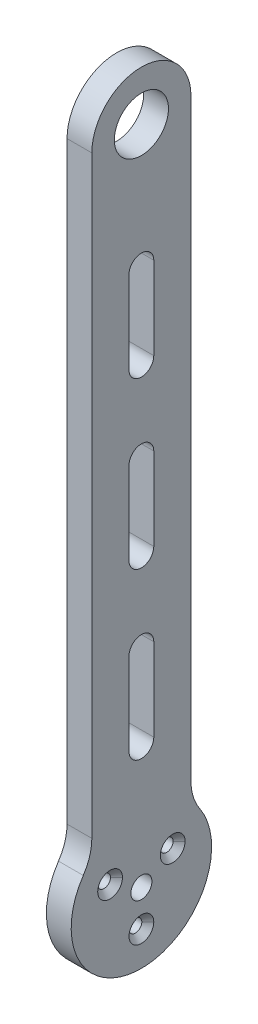
ISO-10303-21;
HEADER;
FILE_DESCRIPTION(('STEP AP214'),'2;1');
FILE_NAME('part.step','',(''),(''),'','','');
FILE_SCHEMA(('AUTOMOTIVE_DESIGN { 1 0 10303 214 1 1 1 1 }'));
ENDSEC;
DATA;
#1=APPLICATION_CONTEXT('core data for automotive mechanical design processes');
#2=APPLICATION_PROTOCOL_DEFINITION('international standard','automotive_design',2000,#1);
#3=PRODUCT_CONTEXT('',#1,'mechanical');
#4=PRODUCT('Part','Part','',(#3));
#5=PRODUCT_RELATED_PRODUCT_CATEGORY('part','',(#4));
#6=PRODUCT_DEFINITION_FORMATION('','',#4);
#7=PRODUCT_DEFINITION_CONTEXT('part definition',#1,'design');
#8=PRODUCT_DEFINITION('design','',#6,#7);
#9=PRODUCT_DEFINITION_SHAPE('','',#8);
#10=(LENGTH_UNIT() NAMED_UNIT(*) SI_UNIT(.MILLI.,.METRE.));
#11=(NAMED_UNIT(*) PLANE_ANGLE_UNIT() SI_UNIT($,.RADIAN.));
#12=(NAMED_UNIT(*) SI_UNIT($,.STERADIAN.) SOLID_ANGLE_UNIT());
#13=UNCERTAINTY_MEASURE_WITH_UNIT(LENGTH_MEASURE(1.E-05),#10,'distance_accuracy_value','');
#14=(GEOMETRIC_REPRESENTATION_CONTEXT(3) GLOBAL_UNCERTAINTY_ASSIGNED_CONTEXT((#13)) GLOBAL_UNIT_ASSIGNED_CONTEXT((#10,
#11,#12)) REPRESENTATION_CONTEXT('',''));
#15=CARTESIAN_POINT('',(0.,0.,0.));
#16=DIRECTION('',(0.,0.,1.));
#17=DIRECTION('',(1.,0.,0.));
#18=AXIS2_PLACEMENT_3D('',#15,#16,#17);
#19=CARTESIAN_POINT('',(1.4159414336793,4.375,7.57772228311384));
#20=DIRECTION('',(1.,0.,0.));
#21=DIRECTION('',(0.,0.,-1.));
#22=AXIS2_PLACEMENT_3D('',#19,#20,#21);
#23=CONICAL_SURFACE('',#22,1.4159414336793,0.785398163397449);
#24=DIRECTION('',(-0.707106781186547,-4.31774598039509E-08,-0.707106781186546));
#25=VECTOR('',#24,1.);
#26=CARTESIAN_POINT('',(2.99999998662978,4.37500018318645,10.5777222697436));
#27=LINE('',#26,#25);
#28=CARTESIAN_POINT('',(2.99999999539441,4.37500005514268,10.5777222785082));
#29=VERTEX_POINT('',#28);
#30=CARTESIAN_POINT('',(1.55,4.37500009464633,9.12772228311382));
#31=VERTEX_POINT('',#30);
#32=EDGE_CURVE('E55',#29,#31,#27,.T.);
#33=ORIENTED_EDGE('',*,*,#32,.T.);
#34=CARTESIAN_POINT('',(1.55,4.375,7.57772228311384));
#35=DIRECTION('',(1.,0.,0.));
#36=DIRECTION('',(0.,0.,-1.));
#37=AXIS2_PLACEMENT_3D('',#34,#35,#36);
#38=CIRCLE('',#37,1.55);
#39=CARTESIAN_POINT('',(1.55,4.37499990535367,6.02772228311384));
#40=VERTEX_POINT('',#39);
#41=EDGE_CURVE('E387',#31,#40,#38,.F.);
#42=ORIENTED_EDGE('',*,*,#41,.T.);
#43=DIRECTION('',(-0.707106781186547,4.31774602128291E-08,0.707106781186546));
#44=VECTOR('',#43,1.);
#45=CARTESIAN_POINT('',(2.99999998662978,4.37499981681355,4.57772229648406));
#46=LINE('',#45,#44);
#47=CARTESIAN_POINT('',(2.99999999539441,4.37499994485732,4.57772228771943));
#48=VERTEX_POINT('',#47);
#49=EDGE_CURVE('E12',#48,#40,#46,.T.);
#50=ORIENTED_EDGE('',*,*,#49,.F.);
#51=CARTESIAN_POINT('',(3.,4.375,7.57772228311384));
#52=DIRECTION('',(-1.,0.,0.));
#53=DIRECTION('',(0.,0.,1.));
#54=AXIS2_PLACEMENT_3D('',#51,#52,#53);
#55=CIRCLE('',#54,3.);
#56=EDGE_CURVE('E464',#29,#48,#55,.T.);
#57=ORIENTED_EDGE('',*,*,#56,.F.);
#58=EDGE_LOOP('',(#33,#42,#50,#57));
#59=FACE_BOUND('',#58,.T.);
#60=ADVANCED_FACE('F52',(#59),#23,.F.);
#61=CARTESIAN_POINT('',(1.4159414336793,4.375,7.57772228311384));
#62=DIRECTION('',(1.,0.,0.));
#63=DIRECTION('',(0.,0.,-1.));
#64=AXIS2_PLACEMENT_3D('',#61,#62,#63);
#65=CONICAL_SURFACE('',#64,1.4159414336793,0.785398163397449);
#66=ORIENTED_EDGE('',*,*,#49,.T.);
#67=CARTESIAN_POINT('',(1.55,4.375,7.57772228311384));
#68=DIRECTION('',(1.,0.,0.));
#69=DIRECTION('',(0.,0.,-1.));
#70=AXIS2_PLACEMENT_3D('',#67,#68,#69);
#71=CIRCLE('',#70,1.55);
#72=EDGE_CURVE('E383',#40,#31,#71,.F.);
#73=ORIENTED_EDGE('',*,*,#72,.T.);
#74=ORIENTED_EDGE('',*,*,#32,.F.);
#75=CARTESIAN_POINT('',(3.,4.375,7.57772228311384));
#76=DIRECTION('',(-1.,0.,0.));
#77=DIRECTION('',(0.,0.,-1.));
#78=AXIS2_PLACEMENT_3D('',#75,#76,#77);
#79=CIRCLE('',#78,3.);
#80=EDGE_CURVE('E460',#48,#29,#79,.T.);
#81=ORIENTED_EDGE('',*,*,#80,.F.);
#82=EDGE_LOOP('',(#66,#73,#74,#81));
#83=FACE_BOUND('',#82,.T.);
#84=ADVANCED_FACE('F542',(#83),#65,.F.);
#85=CARTESIAN_POINT('',(1.4159414336793,4.375,-7.57772228311384));
#86=DIRECTION('',(1.,0.,0.));
#87=DIRECTION('',(0.,0.,-1.));
#88=AXIS2_PLACEMENT_3D('',#85,#86,#87);
#89=CONICAL_SURFACE('',#88,1.4159414336793,0.785398163397449);
#90=DIRECTION('',(-0.707106781186547,-4.31774606217073E-08,-0.707106781186546));
#91=VECTOR('',#90,1.);
#92=CARTESIAN_POINT('',(2.99999998662979,4.37500018318645,-4.57772229648406));
#93=LINE('',#92,#91);
#94=CARTESIAN_POINT('',(2.99999999539441,4.37500005514268,-4.57772228771943));
#95=VERTEX_POINT('',#94);
#96=CARTESIAN_POINT('',(1.55,4.37500009464633,-6.02772228311385));
#97=VERTEX_POINT('',#96);
#98=EDGE_CURVE('E485',#95,#97,#93,.T.);
#99=ORIENTED_EDGE('',*,*,#98,.T.);
#100=CARTESIAN_POINT('',(1.55,4.375,-7.57772228311384));
#101=DIRECTION('',(1.,0.,0.));
#102=DIRECTION('',(0.,0.,-1.));
#103=AXIS2_PLACEMENT_3D('',#100,#101,#102);
#104=CIRCLE('',#103,1.55);
#105=CARTESIAN_POINT('',(1.55,4.37499990535367,-9.12772228311382));
#106=VERTEX_POINT('',#105);
#107=EDGE_CURVE('E363',#97,#106,#104,.F.);
#108=ORIENTED_EDGE('',*,*,#107,.T.);
#109=DIRECTION('',(-0.707106781186548,4.31774598039509E-08,0.707106781186546));
#110=VECTOR('',#109,1.);
#111=CARTESIAN_POINT('',(2.99999998662978,4.37499981681355,-10.5777222697436));
#112=LINE('',#111,#110);
#113=CARTESIAN_POINT('',(2.99999999539441,4.37499994485732,-10.5777222785082));
#114=VERTEX_POINT('',#113);
#115=EDGE_CURVE('E489',#114,#106,#112,.T.);
#116=ORIENTED_EDGE('',*,*,#115,.F.);
#117=CARTESIAN_POINT('',(3.,4.375,-7.57772228311384));
#118=DIRECTION('',(-1.,0.,0.));
#119=DIRECTION('',(0.,0.,1.));
#120=AXIS2_PLACEMENT_3D('',#117,#118,#119);
#121=CIRCLE('',#120,3.);
#122=EDGE_CURVE('E456',#95,#114,#121,.T.);
#123=ORIENTED_EDGE('',*,*,#122,.F.);
#124=EDGE_LOOP('',(#99,#108,#116,#123));
#125=FACE_BOUND('',#124,.T.);
#126=ADVANCED_FACE('F497',(#125),#89,.F.);
#127=CARTESIAN_POINT('',(1.4159414336793,4.375,-7.57772228311384));
#128=DIRECTION('',(1.,0.,0.));
#129=DIRECTION('',(0.,0.,-1.));
#130=AXIS2_PLACEMENT_3D('',#127,#128,#129);
#131=CONICAL_SURFACE('',#130,1.4159414336793,0.785398163397449);
#132=ORIENTED_EDGE('',*,*,#115,.T.);
#133=CARTESIAN_POINT('',(1.55,4.375,-7.57772228311384));
#134=DIRECTION('',(1.,0.,0.));
#135=DIRECTION('',(0.,0.,-1.));
#136=AXIS2_PLACEMENT_3D('',#133,#134,#135);
#137=CIRCLE('',#136,1.55);
#138=EDGE_CURVE('E359',#106,#97,#137,.F.);
#139=ORIENTED_EDGE('',*,*,#138,.T.);
#140=ORIENTED_EDGE('',*,*,#98,.F.);
#141=CARTESIAN_POINT('',(3.,4.375,-7.57772228311384));
#142=DIRECTION('',(-1.,0.,0.));
#143=DIRECTION('',(0.,0.,-1.));
#144=AXIS2_PLACEMENT_3D('',#141,#142,#143);
#145=CIRCLE('',#144,3.);
#146=EDGE_CURVE('E452',#114,#95,#145,.T.);
#147=ORIENTED_EDGE('',*,*,#146,.F.);
#148=EDGE_LOOP('',(#132,#139,#140,#147));
#149=FACE_BOUND('',#148,.T.);
#150=ADVANCED_FACE('F500',(#149),#131,.F.);
#151=CARTESIAN_POINT('',(1.4159414336793,-8.75,0.));
#152=DIRECTION('',(1.,0.,0.));
#153=DIRECTION('',(0.,0.,-1.));
#154=AXIS2_PLACEMENT_3D('',#151,#152,#153);
#155=CONICAL_SURFACE('',#154,1.4159414336793,0.785398163397449);
#156=DIRECTION('',(-0.707106781186547,-4.31774610305856E-08,-0.707106781186546));
#157=VECTOR('',#156,1.);
#158=CARTESIAN_POINT('',(2.99999998662978,-8.74999981681355,2.99999998662978));
#159=LINE('',#158,#157);
#160=CARTESIAN_POINT('',(2.99999999539441,-8.74999994485732,2.99999999539441));
#161=VERTEX_POINT('',#160);
#162=CARTESIAN_POINT('',(1.55,-8.74999990535367,1.55));
#163=VERTEX_POINT('',#162);
#164=EDGE_CURVE('E474',#161,#163,#159,.T.);
#165=ORIENTED_EDGE('',*,*,#164,.T.);
#166=CARTESIAN_POINT('',(1.55,-8.75,0.));
#167=DIRECTION('',(1.,0.,0.));
#168=DIRECTION('',(0.,0.,-1.));
#169=AXIS2_PLACEMENT_3D('',#166,#167,#168);
#170=CIRCLE('',#169,1.55);
#171=CARTESIAN_POINT('',(1.55,-8.75000009464634,-1.55));
#172=VERTEX_POINT('',#171);
#173=EDGE_CURVE('E379',#163,#172,#170,.F.);
#174=ORIENTED_EDGE('',*,*,#173,.T.);
#175=DIRECTION('',(-0.707106781186547,4.31774585773161E-08,0.707106781186546));
#176=VECTOR('',#175,1.);
#177=CARTESIAN_POINT('',(2.99999998662978,-8.75000018318645,-2.99999998662978));
#178=LINE('',#177,#176);
#179=CARTESIAN_POINT('',(2.99999999539441,-8.75000005514268,-2.99999999539441));
#180=VERTEX_POINT('',#179);
#181=EDGE_CURVE('E481',#180,#172,#178,.T.);
#182=ORIENTED_EDGE('',*,*,#181,.F.);
#183=CARTESIAN_POINT('',(3.,-8.75,0.));
#184=DIRECTION('',(-1.,0.,0.));
#185=DIRECTION('',(0.,0.,1.));
#186=AXIS2_PLACEMENT_3D('',#183,#184,#185);
#187=CIRCLE('',#186,3.);
#188=EDGE_CURVE('E448',#161,#180,#187,.T.);
#189=ORIENTED_EDGE('',*,*,#188,.F.);
#190=EDGE_LOOP('',(#165,#174,#182,#189));
#191=FACE_BOUND('',#190,.T.);
#192=ADVANCED_FACE('F553',(#191),#155,.F.);
#193=CARTESIAN_POINT('',(1.4159414336793,-8.75,0.));
#194=DIRECTION('',(1.,0.,0.));
#195=DIRECTION('',(0.,0.,-1.));
#196=AXIS2_PLACEMENT_3D('',#193,#194,#195);
#197=CONICAL_SURFACE('',#196,1.4159414336793,0.785398163397449);
#198=ORIENTED_EDGE('',*,*,#181,.T.);
#199=CARTESIAN_POINT('',(1.55,-8.75,0.));
#200=DIRECTION('',(1.,0.,0.));
#201=DIRECTION('',(0.,0.,-1.));
#202=AXIS2_PLACEMENT_3D('',#199,#200,#201);
#203=CIRCLE('',#202,1.55);
#204=EDGE_CURVE('E375',#172,#163,#203,.F.);
#205=ORIENTED_EDGE('',*,*,#204,.T.);
#206=ORIENTED_EDGE('',*,*,#164,.F.);
#207=CARTESIAN_POINT('',(3.,-8.75,0.));
#208=DIRECTION('',(-1.,0.,0.));
#209=DIRECTION('',(0.,0.,-1.));
#210=AXIS2_PLACEMENT_3D('',#207,#208,#209);
#211=CIRCLE('',#210,3.);
#212=EDGE_CURVE('E444',#180,#161,#211,.T.);
#213=ORIENTED_EDGE('',*,*,#212,.F.);
#214=EDGE_LOOP('',(#198,#205,#206,#213));
#215=FACE_BOUND('',#214,.T.);
#216=ADVANCED_FACE('F556',(#215),#197,.F.);
#217=CARTESIAN_POINT('',(-18.036,16.2788205960997,-24.));
#218=DIRECTION('',(1.,0.,0.));
#219=DIRECTION('',(0.,0.,1.));
#220=AXIS2_PLACEMENT_3D('',#217,#218,#219);
#221=CYLINDRICAL_SURFACE('',#220,12.);
#222=CARTESIAN_POINT('',(3.,16.2788205960997,-24.));
#223=DIRECTION('',(-1.,0.,0.));
#224=DIRECTION('',(0.,-0.561338641244817,0.827586206896552));
#225=AXIS2_PLACEMENT_3D('',#222,#223,#224);
#226=CIRCLE('',#225,12.);
#227=CARTESIAN_POINT('',(3.,9.5427569011619,-14.0689655172414));
#228=VERTEX_POINT('',#227);
#229=CARTESIAN_POINT('',(3.,16.2788205960997,-12.));
#230=VERTEX_POINT('',#229);
#231=EDGE_CURVE('E443',#228,#230,#226,.T.);
#232=ORIENTED_EDGE('',*,*,#231,.F.);
#233=DIRECTION('',(1.,0.,0.));
#234=VECTOR('',#233,1.);
#235=CARTESIAN_POINT('',(-3.,9.5427569011619,-14.0689655172414));
#236=LINE('',#235,#234);
#237=CARTESIAN_POINT('',(-3.,9.5427569011619,-14.0689655172414));
#238=VERTEX_POINT('',#237);
#239=EDGE_CURVE('E426',#238,#228,#236,.T.);
#240=ORIENTED_EDGE('',*,*,#239,.F.);
#241=CARTESIAN_POINT('',(-3.,16.2788205960997,-24.));
#242=DIRECTION('',(1.,0.,0.));
#243=DIRECTION('',(0.,0.,1.));
#244=AXIS2_PLACEMENT_3D('',#241,#242,#243);
#245=CIRCLE('',#244,12.);
#246=CARTESIAN_POINT('',(-3.,16.2788205960997,-12.));
#247=VERTEX_POINT('',#246);
#248=EDGE_CURVE('E400',#247,#238,#245,.T.);
#249=ORIENTED_EDGE('',*,*,#248,.F.);
#250=DIRECTION('',(1.,0.,0.));
#251=VECTOR('',#250,1.);
#252=CARTESIAN_POINT('',(-3.,16.2788205960997,-12.));
#253=LINE('',#252,#251);
#254=EDGE_CURVE('E471',#247,#230,#253,.T.);
#255=ORIENTED_EDGE('',*,*,#254,.T.);
#256=EDGE_LOOP('',(#232,#240,#249,#255));
#257=FACE_BOUND('',#256,.T.);
#258=ADVANCED_FACE('F560',(#257),#221,.F.);
#259=CARTESIAN_POINT('',(-3.,12.0415945787923,-12.));
#260=DIRECTION('',(0.,0.,-1.));
#261=DIRECTION('',(0.,1.,0.));
#262=AXIS2_PLACEMENT_3D('',#259,#260,#261);
#263=PLANE('',#262);
#264=DIRECTION('',(0.,1.,0.));
#265=VECTOR('',#264,1.);
#266=CARTESIAN_POINT('',(-3.,16.2788205960997,-12.));
#267=LINE('',#266,#265);
#268=CARTESIAN_POINT('',(-3.,160.,-12.));
#269=VERTEX_POINT('',#268);
#270=EDGE_CURVE('E401',#247,#269,#267,.T.);
#271=ORIENTED_EDGE('',*,*,#270,.T.);
#272=DIRECTION('',(1.,0.,0.));
#273=VECTOR('',#272,1.);
#274=CARTESIAN_POINT('',(-3.,160.,-12.));
#275=LINE('',#274,#273);
#276=CARTESIAN_POINT('',(3.,160.,-12.));
#277=VERTEX_POINT('',#276);
#278=EDGE_CURVE('E468',#269,#277,#275,.T.);
#279=ORIENTED_EDGE('',*,*,#278,.T.);
#280=DIRECTION('',(0.,1.,0.));
#281=VECTOR('',#280,1.);
#282=CARTESIAN_POINT('',(3.,16.2788205960997,-12.));
#283=LINE('',#282,#281);
#284=EDGE_CURVE('E439',#230,#277,#283,.T.);
#285=ORIENTED_EDGE('',*,*,#284,.F.);
#286=ORIENTED_EDGE('',*,*,#254,.F.);
#287=EDGE_LOOP('',(#271,#279,#285,#286));
#288=FACE_BOUND('',#287,.T.);
#289=ADVANCED_FACE('F564',(#288),#263,.T.);
#290=CARTESIAN_POINT('',(-3.,160.,0.));
#291=DIRECTION('',(1.,0.,0.));
#292=DIRECTION('',(0.,0.,-1.));
#293=AXIS2_PLACEMENT_3D('',#290,#291,#292);
#294=CYLINDRICAL_SURFACE('',#293,12.);
#295=DIRECTION('',(1.,0.,0.));
#296=VECTOR('',#295,1.);
#297=CARTESIAN_POINT('',(-3.,160.,12.));
#298=LINE('',#297,#296);
#299=CARTESIAN_POINT('',(-3.,160.,12.));
#300=VERTEX_POINT('',#299);
#301=CARTESIAN_POINT('',(3.,160.,12.));
#302=VERTEX_POINT('',#301);
#303=EDGE_CURVE('E411',#300,#302,#298,.T.);
#304=ORIENTED_EDGE('',*,*,#303,.T.);
#305=CARTESIAN_POINT('',(3.,160.,0.));
#306=DIRECTION('',(1.,0.,0.));
#307=DIRECTION('',(0.,0.,-1.));
#308=AXIS2_PLACEMENT_3D('',#305,#306,#307);
#309=CIRCLE('',#308,12.);
#310=EDGE_CURVE('E430',#277,#302,#309,.T.);
#311=ORIENTED_EDGE('',*,*,#310,.F.);
#312=ORIENTED_EDGE('',*,*,#278,.F.);
#313=CARTESIAN_POINT('',(-3.,160.,0.));
#314=DIRECTION('',(1.,0.,0.));
#315=DIRECTION('',(0.,0.,-1.));
#316=AXIS2_PLACEMENT_3D('',#313,#314,#315);
#317=CIRCLE('',#316,12.);
#318=EDGE_CURVE('E404',#269,#300,#317,.T.);
#319=ORIENTED_EDGE('',*,*,#318,.T.);
#320=EDGE_LOOP('',(#304,#311,#312,#319));
#321=FACE_BOUND('',#320,.T.);
#322=ADVANCED_FACE('F506',(#321),#294,.T.);
#323=CARTESIAN_POINT('',(3.,0.,0.));
#324=DIRECTION('',(1.,0.,0.));
#325=DIRECTION('',(0.,0.,-1.));
#326=AXIS2_PLACEMENT_3D('',#323,#324,#325);
#327=PLANE('',#326);
#328=CARTESIAN_POINT('',(3.,30.,0.));
#329=DIRECTION('',(1.,0.,0.));
#330=DIRECTION('',(0.,0.,-1.));
#331=AXIS2_PLACEMENT_3D('',#328,#329,#330);
#332=CIRCLE('',#331,3.);
#333=CARTESIAN_POINT('',(3.,30.,3.00000000000001));
#334=VERTEX_POINT('',#333);
#335=CARTESIAN_POINT('',(3.,30.,-2.99999999999999));
#336=VERTEX_POINT('',#335);
#337=EDGE_CURVE('E336',#334,#336,#332,.T.);
#338=ORIENTED_EDGE('',*,*,#337,.F.);
#339=DIRECTION('',(0.,-1.,0.));
#340=VECTOR('',#339,1.);
#341=CARTESIAN_POINT('',(3.,0.,3.00000000000001));
#342=LINE('',#341,#340);
#343=CARTESIAN_POINT('',(3.,50.,3.00000000000001));
#344=VERTEX_POINT('',#343);
#345=EDGE_CURVE('E326',#344,#334,#342,.T.);
#346=ORIENTED_EDGE('',*,*,#345,.F.);
#347=CARTESIAN_POINT('',(3.,50.,0.));
#348=DIRECTION('',(1.,0.,0.));
#349=DIRECTION('',(0.,0.,-1.));
#350=AXIS2_PLACEMENT_3D('',#347,#348,#349);
#351=CIRCLE('',#350,3.);
#352=CARTESIAN_POINT('',(3.,50.,-2.99999999999999));
#353=VERTEX_POINT('',#352);
#354=EDGE_CURVE('E329',#353,#344,#351,.T.);
#355=ORIENTED_EDGE('',*,*,#354,.F.);
#356=DIRECTION('',(0.,-1.,0.));
#357=VECTOR('',#356,1.);
#358=CARTESIAN_POINT('',(3.,0.,-2.99999999999999));
#359=LINE('',#358,#357);
#360=EDGE_CURVE('E332',#353,#336,#359,.T.);
#361=ORIENTED_EDGE('',*,*,#360,.T.);
#362=EDGE_LOOP('',(#338,#346,#355,#361));
#363=FACE_BOUND('',#362,.T.);
#364=CARTESIAN_POINT('',(3.,110.,0.));
#365=DIRECTION('',(1.,0.,0.));
#366=DIRECTION('',(0.,0.,-1.));
#367=AXIS2_PLACEMENT_3D('',#364,#365,#366);
#368=CIRCLE('',#367,3.);
#369=CARTESIAN_POINT('',(3.,110.,3.));
#370=VERTEX_POINT('',#369);
#371=CARTESIAN_POINT('',(3.,110.,-3.));
#372=VERTEX_POINT('',#371);
#373=EDGE_CURVE('E220',#370,#372,#368,.T.);
#374=ORIENTED_EDGE('',*,*,#373,.F.);
#375=DIRECTION('',(0.,-1.,0.));
#376=VECTOR('',#375,1.);
#377=CARTESIAN_POINT('',(3.,0.,3.));
#378=LINE('',#377,#376);
#379=CARTESIAN_POINT('',(3.,130.,3.));
#380=VERTEX_POINT('',#379);
#381=EDGE_CURVE('E315',#380,#370,#378,.T.);
#382=ORIENTED_EDGE('',*,*,#381,.F.);
#383=CARTESIAN_POINT('',(3.,130.,0.));
#384=DIRECTION('',(1.,0.,0.));
#385=DIRECTION('',(0.,0.,-1.));
#386=AXIS2_PLACEMENT_3D('',#383,#384,#385);
#387=CIRCLE('',#386,3.);
#388=CARTESIAN_POINT('',(3.,130.,-3.));
#389=VERTEX_POINT('',#388);
#390=EDGE_CURVE('E318',#389,#380,#387,.T.);
#391=ORIENTED_EDGE('',*,*,#390,.F.);
#392=DIRECTION('',(0.,-1.,0.));
#393=VECTOR('',#392,1.);
#394=CARTESIAN_POINT('',(3.,0.,-3.));
#395=LINE('',#394,#393);
#396=EDGE_CURVE('E321',#389,#372,#395,.T.);
#397=ORIENTED_EDGE('',*,*,#396,.T.);
#398=EDGE_LOOP('',(#374,#382,#391,#397));
#399=FACE_BOUND('',#398,.T.);
#400=CARTESIAN_POINT('',(3.,70.,0.));
#401=DIRECTION('',(1.,0.,0.));
#402=DIRECTION('',(0.,0.,-1.));
#403=AXIS2_PLACEMENT_3D('',#400,#401,#402);
#404=CIRCLE('',#403,3.);
#405=CARTESIAN_POINT('',(3.,70.,3.00000000000001));
#406=VERTEX_POINT('',#405);
#407=CARTESIAN_POINT('',(3.,70.,-2.99999999999999));
#408=VERTEX_POINT('',#407);
#409=EDGE_CURVE('E312',#406,#408,#404,.T.);
#410=ORIENTED_EDGE('',*,*,#409,.F.);
#411=DIRECTION('',(0.,-1.,0.));
#412=VECTOR('',#411,1.);
#413=CARTESIAN_POINT('',(3.,0.,3.00000000000001));
#414=LINE('',#413,#412);
#415=CARTESIAN_POINT('',(3.,90.,3.00000000000001));
#416=VERTEX_POINT('',#415);
#417=EDGE_CURVE('E292',#416,#406,#414,.T.);
#418=ORIENTED_EDGE('',*,*,#417,.F.);
#419=CARTESIAN_POINT('',(3.,90.,0.));
#420=DIRECTION('',(1.,0.,0.));
#421=DIRECTION('',(0.,0.,-1.));
#422=AXIS2_PLACEMENT_3D('',#419,#420,#421);
#423=CIRCLE('',#422,3.);
#424=CARTESIAN_POINT('',(3.,90.,-2.99999999999999));
#425=VERTEX_POINT('',#424);
#426=EDGE_CURVE('E304',#425,#416,#423,.T.);
#427=ORIENTED_EDGE('',*,*,#426,.F.);
#428=DIRECTION('',(0.,-1.,0.));
#429=VECTOR('',#428,1.);
#430=CARTESIAN_POINT('',(3.,0.,-2.99999999999999));
#431=LINE('',#430,#429);
#432=EDGE_CURVE('E308',#425,#408,#431,.T.);
#433=ORIENTED_EDGE('',*,*,#432,.T.);
#434=EDGE_LOOP('',(#410,#418,#427,#433));
#435=FACE_BOUND('',#434,.T.);
#436=ORIENTED_EDGE('',*,*,#231,.T.);
#437=ORIENTED_EDGE('',*,*,#284,.T.);
#438=ORIENTED_EDGE('',*,*,#310,.T.);
#439=DIRECTION('',(0.,-1.,0.));
#440=VECTOR('',#439,1.);
#441=CARTESIAN_POINT('',(3.,160.,12.));
#442=LINE('',#441,#440);
#443=CARTESIAN_POINT('',(3.,16.2788205960997,12.));
#444=VERTEX_POINT('',#443);
#445=EDGE_CURVE('E414',#302,#444,#442,.T.);
#446=ORIENTED_EDGE('',*,*,#445,.T.);
#447=CARTESIAN_POINT('',(3.,16.2788205960997,24.));
#448=DIRECTION('',(-1.,0.,0.));
#449=DIRECTION('',(0.,0.,-1.));
#450=AXIS2_PLACEMENT_3D('',#447,#448,#449);
#451=CIRCLE('',#450,12.);
#452=CARTESIAN_POINT('',(3.,9.5427569011619,14.0689655172414));
#453=VERTEX_POINT('',#452);
#454=EDGE_CURVE('E418',#444,#453,#451,.T.);
#455=ORIENTED_EDGE('',*,*,#454,.T.);
#456=CARTESIAN_POINT('',(3.,0.,0.));
#457=DIRECTION('',(1.,0.,0.));
#458=DIRECTION('',(0.,0.561338641244818,0.827586206896552));
#459=AXIS2_PLACEMENT_3D('',#456,#457,#458);
#460=CIRCLE('',#459,17.);
#461=EDGE_CURVE('E421',#453,#228,#460,.T.);
#462=ORIENTED_EDGE('',*,*,#461,.T.);
#463=EDGE_LOOP('',(#436,#437,#438,#446,#455,#462));
#464=FACE_BOUND('',#463,.T.);
#465=ORIENTED_EDGE('',*,*,#188,.T.);
#466=ORIENTED_EDGE('',*,*,#212,.T.);
#467=EDGE_LOOP('',(#465,#466));
#468=FACE_BOUND('',#467,.T.);
#469=ORIENTED_EDGE('',*,*,#122,.T.);
#470=ORIENTED_EDGE('',*,*,#146,.T.);
#471=EDGE_LOOP('',(#469,#470));
#472=FACE_BOUND('',#471,.T.);
#473=ORIENTED_EDGE('',*,*,#56,.T.);
#474=ORIENTED_EDGE('',*,*,#80,.T.);
#475=EDGE_LOOP('',(#473,#474));
#476=FACE_BOUND('',#475,.T.);
#477=CARTESIAN_POINT('',(3.,160.,0.));
#478=DIRECTION('',(1.,0.,0.));
#479=DIRECTION('',(0.,0.,-1.));
#480=AXIS2_PLACEMENT_3D('',#477,#478,#479);
#481=CIRCLE('',#480,6.55);
#482=CARTESIAN_POINT('',(3.,160.,-6.55));
#483=VERTEX_POINT('',#482);
#484=EDGE_CURVE('E367',#483,#483,#481,.T.);
#485=ORIENTED_EDGE('',*,*,#484,.F.);
#486=EDGE_LOOP('',(#485));
#487=FACE_BOUND('',#486,.T.);
#488=CARTESIAN_POINT('',(3.,0.,0.));
#489=DIRECTION('',(1.,0.,0.));
#490=DIRECTION('',(0.,0.,-1.));
#491=AXIS2_PLACEMENT_3D('',#488,#489,#490);
#492=CIRCLE('',#491,2.55);
#493=CARTESIAN_POINT('',(3.,0.,-2.55));
#494=VERTEX_POINT('',#493);
#495=EDGE_CURVE('E371',#494,#494,#492,.T.);
#496=ORIENTED_EDGE('',*,*,#495,.F.);
#497=EDGE_LOOP('',(#496));
#498=FACE_BOUND('',#497,.T.);
#499=ADVANCED_FACE('F502',(#363,#399,#435,#464,#468,#472,#476,#487,#498),#327,.T.);
#500=CARTESIAN_POINT('',(-3.,0.,0.));
#501=DIRECTION('',(1.,0.,0.));
#502=DIRECTION('',(0.,0.,-1.));
#503=AXIS2_PLACEMENT_3D('',#500,#501,#502);
#504=CYLINDRICAL_SURFACE('',#503,17.);
#505=ORIENTED_EDGE('',*,*,#239,.T.);
#506=ORIENTED_EDGE('',*,*,#461,.F.);
#507=DIRECTION('',(1.,0.,0.));
#508=VECTOR('',#507,1.);
#509=CARTESIAN_POINT('',(-3.,9.5427569011619,14.0689655172414));
#510=LINE('',#509,#508);
#511=CARTESIAN_POINT('',(-3.,9.5427569011619,14.0689655172414));
#512=VERTEX_POINT('',#511);
#513=EDGE_CURVE('E422',#512,#453,#510,.T.);
#514=ORIENTED_EDGE('',*,*,#513,.F.);
#515=CARTESIAN_POINT('',(-3.,0.,0.));
#516=DIRECTION('',(1.,0.,0.));
#517=DIRECTION('',(0.,0.561338641244818,0.827586206896552));
#518=AXIS2_PLACEMENT_3D('',#515,#516,#517);
#519=CIRCLE('',#518,17.);
#520=EDGE_CURVE('E396',#512,#238,#519,.T.);
#521=ORIENTED_EDGE('',*,*,#520,.T.);
#522=EDGE_LOOP('',(#505,#506,#514,#521));
#523=FACE_BOUND('',#522,.T.);
#524=ADVANCED_FACE('F505',(#523),#504,.T.);
#525=CARTESIAN_POINT('',(-18.036,16.2788205960997,24.));
#526=DIRECTION('',(1.,0.,0.));
#527=DIRECTION('',(0.,-0.561338641244817,-0.827586206896552));
#528=AXIS2_PLACEMENT_3D('',#525,#526,#527);
#529=CYLINDRICAL_SURFACE('',#528,12.);
#530=ORIENTED_EDGE('',*,*,#454,.F.);
#531=DIRECTION('',(1.,0.,0.));
#532=VECTOR('',#531,1.);
#533=CARTESIAN_POINT('',(-3.,16.2788205960997,12.));
#534=LINE('',#533,#532);
#535=CARTESIAN_POINT('',(-3.,16.2788205960997,12.));
#536=VERTEX_POINT('',#535);
#537=EDGE_CURVE('E407',#536,#444,#534,.T.);
#538=ORIENTED_EDGE('',*,*,#537,.F.);
#539=CARTESIAN_POINT('',(-3.,16.2788205960997,24.));
#540=DIRECTION('',(1.,0.,0.));
#541=DIRECTION('',(0.,-0.561338641244817,-0.827586206896552));
#542=AXIS2_PLACEMENT_3D('',#539,#540,#541);
#543=CIRCLE('',#542,12.);
#544=EDGE_CURVE('E395',#512,#536,#543,.T.);
#545=ORIENTED_EDGE('',*,*,#544,.F.);
#546=ORIENTED_EDGE('',*,*,#513,.T.);
#547=EDGE_LOOP('',(#530,#538,#545,#546));
#548=FACE_BOUND('',#547,.T.);
#549=ADVANCED_FACE('F574',(#548),#529,.F.);
#550=CARTESIAN_POINT('',(-3.,160.,12.));
#551=DIRECTION('',(0.,0.,1.));
#552=DIRECTION('',(0.,-1.,0.));
#553=AXIS2_PLACEMENT_3D('',#550,#551,#552);
#554=PLANE('',#553);
#555=ORIENTED_EDGE('',*,*,#445,.F.);
#556=ORIENTED_EDGE('',*,*,#303,.F.);
#557=DIRECTION('',(0.,-1.,0.));
#558=VECTOR('',#557,1.);
#559=CARTESIAN_POINT('',(-3.,160.,12.));
#560=LINE('',#559,#558);
#561=EDGE_CURVE('E391',#300,#536,#560,.T.);
#562=ORIENTED_EDGE('',*,*,#561,.T.);
#563=ORIENTED_EDGE('',*,*,#537,.T.);
#564=EDGE_LOOP('',(#555,#556,#562,#563));
#565=FACE_BOUND('',#564,.T.);
#566=ADVANCED_FACE('F525',(#565),#554,.T.);
#567=CARTESIAN_POINT('',(-3.,0.,0.));
#568=DIRECTION('',(1.,0.,0.));
#569=DIRECTION('',(0.,0.,-1.));
#570=AXIS2_PLACEMENT_3D('',#567,#568,#569);
#571=PLANE('',#570);
#572=DIRECTION('',(0.,1.,0.));
#573=VECTOR('',#572,1.);
#574=CARTESIAN_POINT('',(-3.,30.,3.00000000000001));
#575=LINE('',#574,#573);
#576=CARTESIAN_POINT('',(-3.,30.,3.00000000000001));
#577=VERTEX_POINT('',#576);
#578=CARTESIAN_POINT('',(-3.,50.,3.00000000000001));
#579=VERTEX_POINT('',#578);
#580=EDGE_CURVE('E272',#577,#579,#575,.T.);
#581=ORIENTED_EDGE('',*,*,#580,.F.);
#582=CARTESIAN_POINT('',(-3.,30.,0.));
#583=DIRECTION('',(-1.,0.,0.));
#584=DIRECTION('',(0.,0.,1.));
#585=AXIS2_PLACEMENT_3D('',#582,#583,#584);
#586=CIRCLE('',#585,3.);
#587=CARTESIAN_POINT('',(-3.,30.,-2.99999999999999));
#588=VERTEX_POINT('',#587);
#589=EDGE_CURVE('E225',#588,#577,#586,.T.);
#590=ORIENTED_EDGE('',*,*,#589,.F.);
#591=DIRECTION('',(0.,1.,0.));
#592=VECTOR('',#591,1.);
#593=CARTESIAN_POINT('',(-3.,30.,-2.99999999999999));
#594=LINE('',#593,#592);
#595=CARTESIAN_POINT('',(-3.,50.,-2.99999999999999));
#596=VERTEX_POINT('',#595);
#597=EDGE_CURVE('E256',#588,#596,#594,.T.);
#598=ORIENTED_EDGE('',*,*,#597,.T.);
#599=CARTESIAN_POINT('',(-3.,50.,0.));
#600=DIRECTION('',(-1.,0.,0.));
#601=DIRECTION('',(0.,0.,1.));
#602=AXIS2_PLACEMENT_3D('',#599,#600,#601);
#603=CIRCLE('',#602,3.);
#604=EDGE_CURVE('E268',#579,#596,#603,.T.);
#605=ORIENTED_EDGE('',*,*,#604,.F.);
#606=EDGE_LOOP('',(#581,#590,#598,#605));
#607=FACE_BOUND('',#606,.T.);
#608=DIRECTION('',(0.,1.,0.));
#609=VECTOR('',#608,1.);
#610=CARTESIAN_POINT('',(-3.,110.,3.));
#611=LINE('',#610,#609);
#612=CARTESIAN_POINT('',(-3.,110.,3.));
#613=VERTEX_POINT('',#612);
#614=CARTESIAN_POINT('',(-3.,130.,3.));
#615=VERTEX_POINT('',#614);
#616=EDGE_CURVE('E241',#613,#615,#611,.T.);
#617=ORIENTED_EDGE('',*,*,#616,.F.);
#618=CARTESIAN_POINT('',(-3.,110.,0.));
#619=DIRECTION('',(-1.,0.,0.));
#620=DIRECTION('',(0.,0.,1.));
#621=AXIS2_PLACEMENT_3D('',#618,#619,#620);
#622=CIRCLE('',#621,3.);
#623=CARTESIAN_POINT('',(-3.,110.,-3.));
#624=VERTEX_POINT('',#623);
#625=EDGE_CURVE('E217',#624,#613,#622,.T.);
#626=ORIENTED_EDGE('',*,*,#625,.F.);
#627=DIRECTION('',(0.,1.,0.));
#628=VECTOR('',#627,1.);
#629=CARTESIAN_POINT('',(-3.,110.,-3.));
#630=LINE('',#629,#628);
#631=CARTESIAN_POINT('',(-3.,130.,-3.));
#632=VERTEX_POINT('',#631);
#633=EDGE_CURVE('E228',#624,#632,#630,.T.);
#634=ORIENTED_EDGE('',*,*,#633,.T.);
#635=CARTESIAN_POINT('',(-3.,130.,0.));
#636=DIRECTION('',(-1.,0.,0.));
#637=DIRECTION('',(0.,0.,1.));
#638=AXIS2_PLACEMENT_3D('',#635,#636,#637);
#639=CIRCLE('',#638,3.);
#640=EDGE_CURVE('E235',#615,#632,#639,.T.);
#641=ORIENTED_EDGE('',*,*,#640,.F.);
#642=EDGE_LOOP('',(#617,#626,#634,#641));
#643=FACE_BOUND('',#642,.T.);
#644=DIRECTION('',(0.,1.,0.));
#645=VECTOR('',#644,1.);
#646=CARTESIAN_POINT('',(-3.,70.,3.00000000000001));
#647=LINE('',#646,#645);
#648=CARTESIAN_POINT('',(-3.,70.,3.00000000000001));
#649=VERTEX_POINT('',#648);
#650=CARTESIAN_POINT('',(-3.,90.,3.00000000000001));
#651=VERTEX_POINT('',#650);
#652=EDGE_CURVE('E247',#649,#651,#647,.T.);
#653=ORIENTED_EDGE('',*,*,#652,.F.);
#654=CARTESIAN_POINT('',(-3.,70.,0.));
#655=DIRECTION('',(-1.,0.,0.));
#656=DIRECTION('',(0.,0.,1.));
#657=AXIS2_PLACEMENT_3D('',#654,#655,#656);
#658=CIRCLE('',#657,3.);
#659=CARTESIAN_POINT('',(-3.,70.,-2.99999999999999));
#660=VERTEX_POINT('',#659);
#661=EDGE_CURVE('E243',#660,#649,#658,.T.);
#662=ORIENTED_EDGE('',*,*,#661,.F.);
#663=DIRECTION('',(0.,1.,0.));
#664=VECTOR('',#663,1.);
#665=CARTESIAN_POINT('',(-3.,70.,-2.99999999999999));
#666=LINE('',#665,#664);
#667=CARTESIAN_POINT('',(-3.,90.,-2.99999999999999));
#668=VERTEX_POINT('',#667);
#669=EDGE_CURVE('E284',#660,#668,#666,.T.);
#670=ORIENTED_EDGE('',*,*,#669,.T.);
#671=CARTESIAN_POINT('',(-3.,90.,0.));
#672=DIRECTION('',(-1.,0.,0.));
#673=DIRECTION('',(0.,0.,1.));
#674=AXIS2_PLACEMENT_3D('',#671,#672,#673);
#675=CIRCLE('',#674,3.);
#676=EDGE_CURVE('E280',#651,#668,#675,.T.);
#677=ORIENTED_EDGE('',*,*,#676,.F.);
#678=EDGE_LOOP('',(#653,#662,#670,#677));
#679=FACE_BOUND('',#678,.T.);
#680=ORIENTED_EDGE('',*,*,#318,.F.);
#681=ORIENTED_EDGE('',*,*,#270,.F.);
#682=ORIENTED_EDGE('',*,*,#248,.T.);
#683=ORIENTED_EDGE('',*,*,#520,.F.);
#684=ORIENTED_EDGE('',*,*,#544,.T.);
#685=ORIENTED_EDGE('',*,*,#561,.F.);
#686=EDGE_LOOP('',(#680,#681,#682,#683,#684,#685));
#687=FACE_BOUND('',#686,.T.);
#688=CARTESIAN_POINT('',(-3.,4.375,-7.57772228311384));
#689=DIRECTION('',(-1.,0.,0.));
#690=DIRECTION('',(0.,0.,1.));
#691=AXIS2_PLACEMENT_3D('',#688,#689,#690);
#692=CIRCLE('',#691,1.55);
#693=CARTESIAN_POINT('',(-3.,4.375,-6.02772228311384));
#694=VERTEX_POINT('',#693);
#695=EDGE_CURVE('E352',#694,#694,#692,.T.);
#696=ORIENTED_EDGE('',*,*,#695,.F.);
#697=EDGE_LOOP('',(#696));
#698=FACE_BOUND('',#697,.T.);
#699=CARTESIAN_POINT('',(-3.,160.,0.));
#700=DIRECTION('',(-1.,0.,0.));
#701=DIRECTION('',(0.,0.,1.));
#702=AXIS2_PLACEMENT_3D('',#699,#700,#701);
#703=CIRCLE('',#702,6.55);
#704=CARTESIAN_POINT('',(-3.,160.,6.55));
#705=VERTEX_POINT('',#704);
#706=EDGE_CURVE('E339',#705,#705,#703,.T.);
#707=ORIENTED_EDGE('',*,*,#706,.F.);
#708=EDGE_LOOP('',(#707));
#709=FACE_BOUND('',#708,.T.);
#710=CARTESIAN_POINT('',(-3.,0.,0.));
#711=DIRECTION('',(-1.,0.,0.));
#712=DIRECTION('',(0.,0.,1.));
#713=AXIS2_PLACEMENT_3D('',#710,#711,#712);
#714=CIRCLE('',#713,2.55);
#715=CARTESIAN_POINT('',(-3.,0.,2.55));
#716=VERTEX_POINT('',#715);
#717=EDGE_CURVE('E340',#716,#716,#714,.T.);
#718=ORIENTED_EDGE('',*,*,#717,.F.);
#719=EDGE_LOOP('',(#718));
#720=FACE_BOUND('',#719,.T.);
#721=CARTESIAN_POINT('',(-3.,-8.75,0.));
#722=DIRECTION('',(-1.,0.,0.));
#723=DIRECTION('',(0.,0.,1.));
#724=AXIS2_PLACEMENT_3D('',#721,#722,#723);
#725=CIRCLE('',#724,1.55);
#726=CARTESIAN_POINT('',(-3.,-8.75,1.55));
#727=VERTEX_POINT('',#726);
#728=EDGE_CURVE('E344',#727,#727,#725,.T.);
#729=ORIENTED_EDGE('',*,*,#728,.F.);
#730=EDGE_LOOP('',(#729));
#731=FACE_BOUND('',#730,.T.);
#732=CARTESIAN_POINT('',(-3.,4.375,7.57772228311384));
#733=DIRECTION('',(-1.,0.,0.));
#734=DIRECTION('',(0.,0.,1.));
#735=AXIS2_PLACEMENT_3D('',#732,#733,#734);
#736=CIRCLE('',#735,1.55);
#737=CARTESIAN_POINT('',(-3.,4.375,9.12772228311384));
#738=VERTEX_POINT('',#737);
#739=EDGE_CURVE('E348',#738,#738,#736,.T.);
#740=ORIENTED_EDGE('',*,*,#739,.F.);
#741=EDGE_LOOP('',(#740));
#742=FACE_BOUND('',#741,.T.);
#743=ADVANCED_FACE('F239',(#607,#643,#679,#687,#698,#709,#720,#731,#742),#571,.F.);
#744=CARTESIAN_POINT('',(7.,4.375,-7.57772228311384));
#745=DIRECTION('',(-1.,0.,0.));
#746=DIRECTION('',(0.,0.,1.));
#747=AXIS2_PLACEMENT_3D('',#744,#745,#746);
#748=CYLINDRICAL_SURFACE('',#747,1.55);
#749=ORIENTED_EDGE('',*,*,#695,.T.);
#750=EDGE_LOOP('',(#749));
#751=FACE_BOUND('',#750,.T.);
#752=ORIENTED_EDGE('',*,*,#138,.F.);
#753=ORIENTED_EDGE('',*,*,#107,.F.);
#754=EDGE_LOOP('',(#752,#753));
#755=FACE_BOUND('',#754,.T.);
#756=ADVANCED_FACE('F524',(#751,#755),#748,.F.);
#757=CARTESIAN_POINT('',(7.,160.,0.));
#758=DIRECTION('',(-1.,0.,0.));
#759=DIRECTION('',(0.,0.,1.));
#760=AXIS2_PLACEMENT_3D('',#757,#758,#759);
#761=CYLINDRICAL_SURFACE('',#760,6.55);
#762=ORIENTED_EDGE('',*,*,#484,.T.);
#763=EDGE_LOOP('',(#762));
#764=FACE_BOUND('',#763,.T.);
#765=ORIENTED_EDGE('',*,*,#706,.T.);
#766=EDGE_LOOP('',(#765));
#767=FACE_BOUND('',#766,.T.);
#768=ADVANCED_FACE('F518',(#764,#767),#761,.F.);
#769=CARTESIAN_POINT('',(7.,0.,0.));
#770=DIRECTION('',(-1.,0.,0.));
#771=DIRECTION('',(0.,0.,1.));
#772=AXIS2_PLACEMENT_3D('',#769,#770,#771);
#773=CYLINDRICAL_SURFACE('',#772,2.55);
#774=ORIENTED_EDGE('',*,*,#495,.T.);
#775=EDGE_LOOP('',(#774));
#776=FACE_BOUND('',#775,.T.);
#777=ORIENTED_EDGE('',*,*,#717,.T.);
#778=EDGE_LOOP('',(#777));
#779=FACE_BOUND('',#778,.T.);
#780=ADVANCED_FACE('F514',(#776,#779),#773,.F.);
#781=CARTESIAN_POINT('',(7.,-8.75,0.));
#782=DIRECTION('',(-1.,0.,0.));
#783=DIRECTION('',(0.,0.,1.));
#784=AXIS2_PLACEMENT_3D('',#781,#782,#783);
#785=CYLINDRICAL_SURFACE('',#784,1.55);
#786=ORIENTED_EDGE('',*,*,#728,.T.);
#787=EDGE_LOOP('',(#786));
#788=FACE_BOUND('',#787,.T.);
#789=ORIENTED_EDGE('',*,*,#204,.F.);
#790=ORIENTED_EDGE('',*,*,#173,.F.);
#791=EDGE_LOOP('',(#789,#790));
#792=FACE_BOUND('',#791,.T.);
#793=ADVANCED_FACE('F517',(#788,#792),#785,.F.);
#794=CARTESIAN_POINT('',(7.,4.375,7.57772228311384));
#795=DIRECTION('',(-1.,0.,0.));
#796=DIRECTION('',(0.,0.,1.));
#797=AXIS2_PLACEMENT_3D('',#794,#795,#796);
#798=CYLINDRICAL_SURFACE('',#797,1.55);
#799=ORIENTED_EDGE('',*,*,#739,.T.);
#800=EDGE_LOOP('',(#799));
#801=FACE_BOUND('',#800,.T.);
#802=ORIENTED_EDGE('',*,*,#72,.F.);
#803=ORIENTED_EDGE('',*,*,#41,.F.);
#804=EDGE_LOOP('',(#802,#803));
#805=FACE_BOUND('',#804,.T.);
#806=ADVANCED_FACE('F532',(#801,#805),#798,.F.);
#807=CARTESIAN_POINT('',(13.,70.,0.));
#808=DIRECTION('',(-1.,0.,0.));
#809=DIRECTION('',(0.,0.,1.));
#810=AXIS2_PLACEMENT_3D('',#807,#808,#809);
#811=CYLINDRICAL_SURFACE('',#810,3.);
#812=ORIENTED_EDGE('',*,*,#409,.T.);
#813=DIRECTION('',(-1.,0.,0.));
#814=VECTOR('',#813,1.);
#815=CARTESIAN_POINT('',(13.,70.,-2.99999999999999));
#816=LINE('',#815,#814);
#817=EDGE_CURVE('E289',#408,#660,#816,.T.);
#818=ORIENTED_EDGE('',*,*,#817,.T.);
#819=ORIENTED_EDGE('',*,*,#661,.T.);
#820=DIRECTION('',(-1.,0.,0.));
#821=VECTOR('',#820,1.);
#822=CARTESIAN_POINT('',(13.,70.,3.00000000000001));
#823=LINE('',#822,#821);
#824=EDGE_CURVE('E288',#406,#649,#823,.T.);
#825=ORIENTED_EDGE('',*,*,#824,.F.);
#826=EDGE_LOOP('',(#812,#818,#819,#825));
#827=FACE_BOUND('',#826,.T.);
#828=ADVANCED_FACE('F535',(#827),#811,.F.);
#829=CARTESIAN_POINT('',(13.,70.,-2.99999999999999));
#830=DIRECTION('',(0.,0.,1.));
#831=DIRECTION('',(1.,0.,0.));
#832=AXIS2_PLACEMENT_3D('',#829,#830,#831);
#833=PLANE('',#832);
#834=DIRECTION('',(-1.,0.,0.));
#835=VECTOR('',#834,1.);
#836=CARTESIAN_POINT('',(13.,90.,-2.99999999999999));
#837=LINE('',#836,#835);
#838=EDGE_CURVE('E293',#425,#668,#837,.T.);
#839=ORIENTED_EDGE('',*,*,#838,.T.);
#840=ORIENTED_EDGE('',*,*,#669,.F.);
#841=ORIENTED_EDGE('',*,*,#817,.F.);
#842=ORIENTED_EDGE('',*,*,#432,.F.);
#843=EDGE_LOOP('',(#839,#840,#841,#842));
#844=FACE_BOUND('',#843,.T.);
#845=ADVANCED_FACE('F593',(#844),#833,.T.);
#846=CARTESIAN_POINT('',(13.,90.,0.));
#847=DIRECTION('',(-1.,0.,0.));
#848=DIRECTION('',(0.,0.,1.));
#849=AXIS2_PLACEMENT_3D('',#846,#847,#848);
#850=CYLINDRICAL_SURFACE('',#849,3.);
#851=ORIENTED_EDGE('',*,*,#426,.T.);
#852=DIRECTION('',(-1.,0.,0.));
#853=VECTOR('',#852,1.);
#854=CARTESIAN_POINT('',(13.,90.,3.00000000000001));
#855=LINE('',#854,#853);
#856=EDGE_CURVE('E296',#416,#651,#855,.T.);
#857=ORIENTED_EDGE('',*,*,#856,.T.);
#858=ORIENTED_EDGE('',*,*,#676,.T.);
#859=ORIENTED_EDGE('',*,*,#838,.F.);
#860=EDGE_LOOP('',(#851,#857,#858,#859));
#861=FACE_BOUND('',#860,.T.);
#862=ADVANCED_FACE('F598',(#861),#850,.F.);
#863=CARTESIAN_POINT('',(13.,70.,3.00000000000001));
#864=DIRECTION('',(0.,0.,1.));
#865=DIRECTION('',(1.,0.,0.));
#866=AXIS2_PLACEMENT_3D('',#863,#864,#865);
#867=PLANE('',#866);
#868=ORIENTED_EDGE('',*,*,#417,.T.);
#869=ORIENTED_EDGE('',*,*,#824,.T.);
#870=ORIENTED_EDGE('',*,*,#652,.T.);
#871=ORIENTED_EDGE('',*,*,#856,.F.);
#872=EDGE_LOOP('',(#868,#869,#870,#871));
#873=FACE_BOUND('',#872,.T.);
#874=ADVANCED_FACE('F595',(#873),#867,.F.);
#875=CARTESIAN_POINT('',(13.,110.,0.));
#876=DIRECTION('',(-1.,0.,0.));
#877=DIRECTION('',(0.,0.,1.));
#878=AXIS2_PLACEMENT_3D('',#875,#876,#877);
#879=CYLINDRICAL_SURFACE('',#878,3.);
#880=ORIENTED_EDGE('',*,*,#373,.T.);
#881=DIRECTION('',(-1.,0.,0.));
#882=VECTOR('',#881,1.);
#883=CARTESIAN_POINT('',(13.,110.,-3.));
#884=LINE('',#883,#882);
#885=EDGE_CURVE('E212',#372,#624,#884,.T.);
#886=ORIENTED_EDGE('',*,*,#885,.T.);
#887=ORIENTED_EDGE('',*,*,#625,.T.);
#888=DIRECTION('',(-1.,0.,0.));
#889=VECTOR('',#888,1.);
#890=CARTESIAN_POINT('',(13.,110.,3.));
#891=LINE('',#890,#889);
#892=EDGE_CURVE('E236',#370,#613,#891,.T.);
#893=ORIENTED_EDGE('',*,*,#892,.F.);
#894=EDGE_LOOP('',(#880,#886,#887,#893));
#895=FACE_BOUND('',#894,.T.);
#896=ADVANCED_FACE('F214',(#895),#879,.F.);
#897=CARTESIAN_POINT('',(13.,110.,-3.));
#898=DIRECTION('',(0.,0.,1.));
#899=DIRECTION('',(1.,0.,0.));
#900=AXIS2_PLACEMENT_3D('',#897,#898,#899);
#901=PLANE('',#900);
#902=DIRECTION('',(-1.,0.,0.));
#903=VECTOR('',#902,1.);
#904=CARTESIAN_POINT('',(13.,130.,-3.));
#905=LINE('',#904,#903);
#906=EDGE_CURVE('E224',#389,#632,#905,.T.);
#907=ORIENTED_EDGE('',*,*,#906,.T.);
#908=ORIENTED_EDGE('',*,*,#633,.F.);
#909=ORIENTED_EDGE('',*,*,#885,.F.);
#910=ORIENTED_EDGE('',*,*,#396,.F.);
#911=EDGE_LOOP('',(#907,#908,#909,#910));
#912=FACE_BOUND('',#911,.T.);
#913=ADVANCED_FACE('F229',(#912),#901,.T.);
#914=CARTESIAN_POINT('',(13.,130.,0.));
#915=DIRECTION('',(-1.,0.,0.));
#916=DIRECTION('',(0.,0.,1.));
#917=AXIS2_PLACEMENT_3D('',#914,#915,#916);
#918=CYLINDRICAL_SURFACE('',#917,3.);
#919=ORIENTED_EDGE('',*,*,#390,.T.);
#920=DIRECTION('',(-1.,0.,0.));
#921=VECTOR('',#920,1.);
#922=CARTESIAN_POINT('',(13.,130.,3.));
#923=LINE('',#922,#921);
#924=EDGE_CURVE('E75',#380,#615,#923,.T.);
#925=ORIENTED_EDGE('',*,*,#924,.T.);
#926=ORIENTED_EDGE('',*,*,#640,.T.);
#927=ORIENTED_EDGE('',*,*,#906,.F.);
#928=EDGE_LOOP('',(#919,#925,#926,#927));
#929=FACE_BOUND('',#928,.T.);
#930=ADVANCED_FACE('F624',(#929),#918,.F.);
#931=CARTESIAN_POINT('',(13.,110.,3.));
#932=DIRECTION('',(0.,0.,1.));
#933=DIRECTION('',(1.,0.,0.));
#934=AXIS2_PLACEMENT_3D('',#931,#932,#933);
#935=PLANE('',#934);
#936=ORIENTED_EDGE('',*,*,#381,.T.);
#937=ORIENTED_EDGE('',*,*,#892,.T.);
#938=ORIENTED_EDGE('',*,*,#616,.T.);
#939=ORIENTED_EDGE('',*,*,#924,.F.);
#940=EDGE_LOOP('',(#936,#937,#938,#939));
#941=FACE_BOUND('',#940,.T.);
#942=ADVANCED_FACE('F620',(#941),#935,.F.);
#943=CARTESIAN_POINT('',(13.,30.,0.));
#944=DIRECTION('',(-1.,0.,0.));
#945=DIRECTION('',(0.,0.,1.));
#946=AXIS2_PLACEMENT_3D('',#943,#944,#945);
#947=CYLINDRICAL_SURFACE('',#946,3.);
#948=ORIENTED_EDGE('',*,*,#337,.T.);
#949=DIRECTION('',(-1.,0.,0.));
#950=VECTOR('',#949,1.);
#951=CARTESIAN_POINT('',(13.,30.,-2.99999999999999));
#952=LINE('',#951,#950);
#953=EDGE_CURVE('E262',#336,#588,#952,.T.);
#954=ORIENTED_EDGE('',*,*,#953,.T.);
#955=ORIENTED_EDGE('',*,*,#589,.T.);
#956=DIRECTION('',(-1.,0.,0.));
#957=VECTOR('',#956,1.);
#958=CARTESIAN_POINT('',(13.,30.,3.00000000000001));
#959=LINE('',#958,#957);
#960=EDGE_CURVE('E252',#334,#577,#959,.T.);
#961=ORIENTED_EDGE('',*,*,#960,.F.);
#962=EDGE_LOOP('',(#948,#954,#955,#961));
#963=FACE_BOUND('',#962,.T.);
#964=ADVANCED_FACE('F610',(#963),#947,.F.);
#965=CARTESIAN_POINT('',(13.,30.,-2.99999999999999));
#966=DIRECTION('',(0.,0.,1.));
#967=DIRECTION('',(1.,0.,0.));
#968=AXIS2_PLACEMENT_3D('',#965,#966,#967);
#969=PLANE('',#968);
#970=DIRECTION('',(-1.,0.,0.));
#971=VECTOR('',#970,1.);
#972=CARTESIAN_POINT('',(13.,50.,-2.99999999999999));
#973=LINE('',#972,#971);
#974=EDGE_CURVE('E259',#353,#596,#973,.T.);
#975=ORIENTED_EDGE('',*,*,#974,.T.);
#976=ORIENTED_EDGE('',*,*,#597,.F.);
#977=ORIENTED_EDGE('',*,*,#953,.F.);
#978=ORIENTED_EDGE('',*,*,#360,.F.);
#979=EDGE_LOOP('',(#975,#976,#977,#978));
#980=FACE_BOUND('',#979,.T.);
#981=ADVANCED_FACE('F606',(#980),#969,.T.);
#982=CARTESIAN_POINT('',(13.,50.,0.));
#983=DIRECTION('',(-1.,0.,0.));
#984=DIRECTION('',(0.,0.,1.));
#985=AXIS2_PLACEMENT_3D('',#982,#983,#984);
#986=CYLINDRICAL_SURFACE('',#985,3.);
#987=ORIENTED_EDGE('',*,*,#354,.T.);
#988=DIRECTION('',(-1.,0.,0.));
#989=VECTOR('',#988,1.);
#990=CARTESIAN_POINT('',(13.,50.,3.00000000000001));
#991=LINE('',#990,#989);
#992=EDGE_CURVE('E67',#344,#579,#991,.T.);
#993=ORIENTED_EDGE('',*,*,#992,.T.);
#994=ORIENTED_EDGE('',*,*,#604,.T.);
#995=ORIENTED_EDGE('',*,*,#974,.F.);
#996=EDGE_LOOP('',(#987,#993,#994,#995));
#997=FACE_BOUND('',#996,.T.);
#998=ADVANCED_FACE('F609',(#997),#986,.F.);
#999=CARTESIAN_POINT('',(13.,30.,3.00000000000001));
#1000=DIRECTION('',(0.,0.,1.));
#1001=DIRECTION('',(1.,0.,0.));
#1002=AXIS2_PLACEMENT_3D('',#999,#1000,#1001);
#1003=PLANE('',#1002);
#1004=ORIENTED_EDGE('',*,*,#345,.T.);
#1005=ORIENTED_EDGE('',*,*,#960,.T.);
#1006=ORIENTED_EDGE('',*,*,#580,.T.);
#1007=ORIENTED_EDGE('',*,*,#992,.F.);
#1008=EDGE_LOOP('',(#1004,#1005,#1006,#1007));
#1009=FACE_BOUND('',#1008,.T.);
#1010=ADVANCED_FACE('F614',(#1009),#1003,.F.);
#1011=CLOSED_SHELL('',(#60,#84,#126,#150,#192,#216,#258,#289,#322,#499,#524,#549,#566,#743,#756,
#768,#780,#793,#806,#828,#845,#862,#874,#896,#913,#930,#942,#964,#981,#998,#1010));
#1012=MANIFOLD_SOLID_BREP('B2',#1011);
#1013=ADVANCED_BREP_SHAPE_REPRESENTATION('',(#18,#1012),#14);
#1014=SHAPE_DEFINITION_REPRESENTATION(#9,#1013);
ENDSEC;
END-ISO-10303-21;
